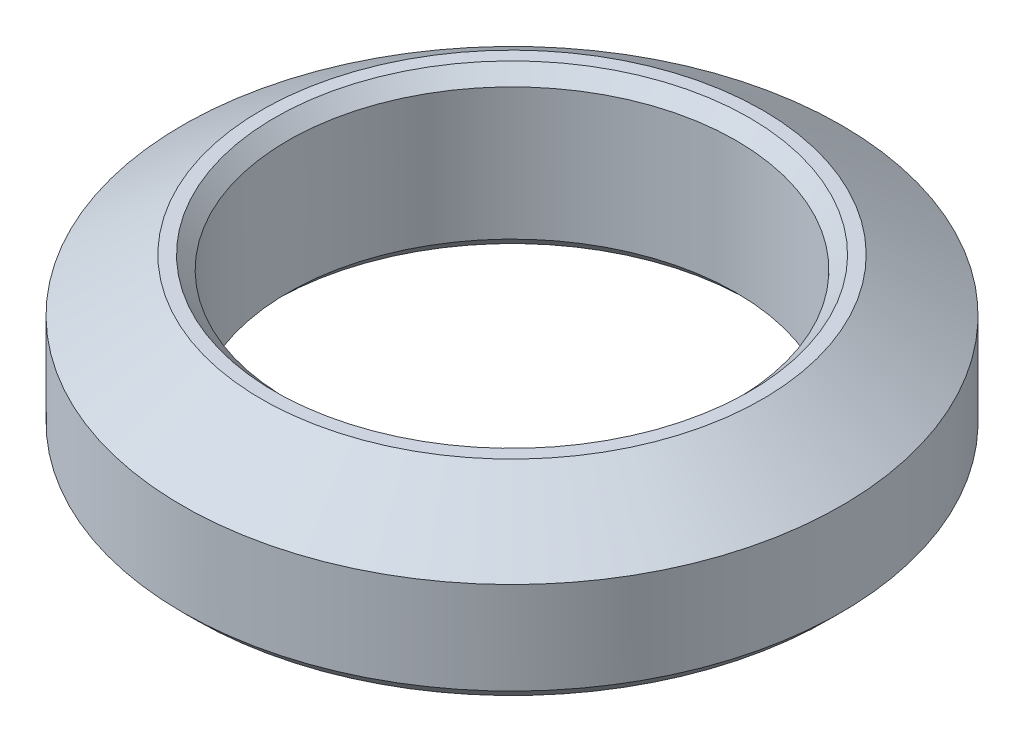
ISO-10303-21;
HEADER;
FILE_DESCRIPTION(('STEP AP214'),'2;1');
FILE_NAME('part.step','',(''),(''),'','','');
FILE_SCHEMA(('AUTOMOTIVE_DESIGN { 1 0 10303 214 1 1 1 1 }'));
ENDSEC;
DATA;
#1=APPLICATION_CONTEXT('core data for automotive mechanical design processes');
#2=APPLICATION_PROTOCOL_DEFINITION('international standard','automotive_design',2000,#1);
#3=PRODUCT_CONTEXT('',#1,'mechanical');
#4=PRODUCT('Part','Part','',(#3));
#5=PRODUCT_RELATED_PRODUCT_CATEGORY('part','',(#4));
#6=PRODUCT_DEFINITION_FORMATION('','',#4);
#7=PRODUCT_DEFINITION_CONTEXT('part definition',#1,'design');
#8=PRODUCT_DEFINITION('design','',#6,#7);
#9=PRODUCT_DEFINITION_SHAPE('','',#8);
#10=(LENGTH_UNIT() NAMED_UNIT(*) SI_UNIT(.MILLI.,.METRE.));
#11=(NAMED_UNIT(*) PLANE_ANGLE_UNIT() SI_UNIT($,.RADIAN.));
#12=(NAMED_UNIT(*) SI_UNIT($,.STERADIAN.) SOLID_ANGLE_UNIT());
#13=UNCERTAINTY_MEASURE_WITH_UNIT(LENGTH_MEASURE(1.E-05),#10,'distance_accuracy_value','');
#14=(GEOMETRIC_REPRESENTATION_CONTEXT(3) GLOBAL_UNCERTAINTY_ASSIGNED_CONTEXT((#13)) GLOBAL_UNIT_ASSIGNED_CONTEXT((#10,
#11,#12)) REPRESENTATION_CONTEXT('',''));
#15=CARTESIAN_POINT('',(0.,0.,0.));
#16=DIRECTION('',(0.,0.,1.));
#17=DIRECTION('',(1.,0.,0.));
#18=AXIS2_PLACEMENT_3D('',#15,#16,#17);
#19=CARTESIAN_POINT('',(-4.75,3.,0.));
#20=DIRECTION('',(0.,-1.,0.));
#21=DIRECTION('',(0.,0.,-1.));
#22=AXIS2_PLACEMENT_3D('',#19,#20,#21);
#23=PLANE('',#22);
#24=CARTESIAN_POINT('',(0.,3.,0.));
#25=DIRECTION('',(0.,-1.,0.));
#26=DIRECTION('',(0.,0.,-1.));
#27=AXIS2_PLACEMENT_3D('',#24,#25,#26);
#28=CIRCLE('',#27,4.5);
#29=CARTESIAN_POINT('',(0.,3.,-4.5));
#30=VERTEX_POINT('',#29);
#31=EDGE_CURVE('E54',#30,#30,#28,.T.);
#32=ORIENTED_EDGE('',*,*,#31,.T.);
#33=EDGE_LOOP('',(#32));
#34=FACE_BOUND('',#33,.T.);
#35=CARTESIAN_POINT('',(0.,3.,0.));
#36=DIRECTION('',(0.,-1.,0.));
#37=DIRECTION('',(0.,0.,-1.));
#38=AXIS2_PLACEMENT_3D('',#35,#36,#37);
#39=CIRCLE('',#38,4.75);
#40=CARTESIAN_POINT('',(0.,3.,-4.75));
#41=VERTEX_POINT('',#40);
#42=EDGE_CURVE('E60',#41,#41,#39,.T.);
#43=ORIENTED_EDGE('',*,*,#42,.F.);
#44=EDGE_LOOP('',(#43));
#45=FACE_BOUND('',#44,.T.);
#46=ADVANCED_FACE('F31',(#34,#45),#23,.F.);
#47=CARTESIAN_POINT('',(0.,0.,0.));
#48=DIRECTION('',(0.,-1.,0.));
#49=DIRECTION('',(0.,0.,-1.));
#50=AXIS2_PLACEMENT_3D('',#47,#48,#49);
#51=CYLINDRICAL_SURFACE('',#50,4.25);
#52=CARTESIAN_POINT('',(0.,2.75,0.));
#53=DIRECTION('',(0.,-1.,0.));
#54=DIRECTION('',(0.,0.,-1.));
#55=AXIS2_PLACEMENT_3D('',#52,#53,#54);
#56=CIRCLE('',#55,4.25);
#57=CARTESIAN_POINT('',(0.,2.75,-4.25));
#58=VERTEX_POINT('',#57);
#59=EDGE_CURVE('E46',#58,#58,#56,.F.);
#60=ORIENTED_EDGE('',*,*,#59,.T.);
#61=EDGE_LOOP('',(#60));
#62=FACE_BOUND('',#61,.T.);
#63=CARTESIAN_POINT('',(0.,0.250000000000003,0.));
#64=DIRECTION('',(0.,1.,0.));
#65=DIRECTION('',(0.,0.,1.));
#66=AXIS2_PLACEMENT_3D('',#63,#64,#65);
#67=CIRCLE('',#66,4.25);
#68=CARTESIAN_POINT('',(0.,0.250000000000003,4.25));
#69=VERTEX_POINT('',#68);
#70=EDGE_CURVE('E51',#69,#69,#67,.F.);
#71=ORIENTED_EDGE('',*,*,#70,.T.);
#72=EDGE_LOOP('',(#71));
#73=FACE_BOUND('',#72,.T.);
#74=ADVANCED_FACE('F67',(#62,#73),#51,.F.);
#75=CARTESIAN_POINT('',(-4.25,0.,0.));
#76=DIRECTION('',(0.,1.,0.));
#77=DIRECTION('',(0.,0.,1.));
#78=AXIS2_PLACEMENT_3D('',#75,#76,#77);
#79=PLANE('',#78);
#80=CARTESIAN_POINT('',(0.,0.,0.));
#81=DIRECTION('',(0.,1.,0.));
#82=DIRECTION('',(0.,0.,1.));
#83=AXIS2_PLACEMENT_3D('',#80,#81,#82);
#84=CIRCLE('',#83,4.5);
#85=CARTESIAN_POINT('',(0.,0.,4.5));
#86=VERTEX_POINT('',#85);
#87=EDGE_CURVE('E38',#86,#86,#84,.T.);
#88=ORIENTED_EDGE('',*,*,#87,.T.);
#89=EDGE_LOOP('',(#88));
#90=FACE_BOUND('',#89,.T.);
#91=CARTESIAN_POINT('',(0.,0.,0.));
#92=DIRECTION('',(0.,1.,0.));
#93=DIRECTION('',(0.,0.,1.));
#94=AXIS2_PLACEMENT_3D('',#91,#92,#93);
#95=CIRCLE('',#94,6.);
#96=CARTESIAN_POINT('',(0.,0.,6.));
#97=VERTEX_POINT('',#96);
#98=EDGE_CURVE('E42',#97,#97,#95,.F.);
#99=ORIENTED_EDGE('',*,*,#98,.T.);
#100=EDGE_LOOP('',(#99));
#101=FACE_BOUND('',#100,.T.);
#102=ADVANCED_FACE('F73',(#90,#101),#79,.F.);
#103=CARTESIAN_POINT('',(0.,0.,0.));
#104=DIRECTION('',(0.,-1.,0.));
#105=DIRECTION('',(0.,0.,-1.));
#106=AXIS2_PLACEMENT_3D('',#103,#104,#105);
#107=CYLINDRICAL_SURFACE('',#106,6.25);
#108=CARTESIAN_POINT('',(0.,0.250000000000003,0.));
#109=DIRECTION('',(0.,1.,0.));
#110=DIRECTION('',(0.,0.,1.));
#111=AXIS2_PLACEMENT_3D('',#108,#109,#110);
#112=CIRCLE('',#111,6.25);
#113=CARTESIAN_POINT('',(0.,0.250000000000003,6.25));
#114=VERTEX_POINT('',#113);
#115=EDGE_CURVE('E10',#114,#114,#112,.T.);
#116=ORIENTED_EDGE('',*,*,#115,.T.);
#117=EDGE_LOOP('',(#116));
#118=FACE_BOUND('',#117,.T.);
#119=CARTESIAN_POINT('',(0.,2.,0.));
#120=DIRECTION('',(0.,-1.,0.));
#121=DIRECTION('',(0.,0.,-1.));
#122=AXIS2_PLACEMENT_3D('',#119,#120,#121);
#123=CIRCLE('',#122,6.25);
#124=CARTESIAN_POINT('',(0.,2.,-6.25));
#125=VERTEX_POINT('',#124);
#126=EDGE_CURVE('E57',#125,#125,#123,.T.);
#127=ORIENTED_EDGE('',*,*,#126,.T.);
#128=EDGE_LOOP('',(#127));
#129=FACE_BOUND('',#128,.T.);
#130=ADVANCED_FACE('F97',(#118,#129),#107,.T.);
#131=CARTESIAN_POINT('',(0.,3.,0.));
#132=DIRECTION('',(0.,-1.,0.));
#133=DIRECTION('',(0.,0.,-1.));
#134=AXIS2_PLACEMENT_3D('',#131,#132,#133);
#135=CONICAL_SURFACE('',#134,4.75,0.982793723247329);
#136=ORIENTED_EDGE('',*,*,#126,.F.);
#137=EDGE_LOOP('',(#136));
#138=FACE_BOUND('',#137,.T.);
#139=ORIENTED_EDGE('',*,*,#42,.T.);
#140=EDGE_LOOP('',(#139));
#141=FACE_BOUND('',#140,.T.);
#142=ADVANCED_FACE('F64',(#138,#141),#135,.T.);
#143=CARTESIAN_POINT('',(0.,3.,0.));
#144=DIRECTION('',(0.,1.,0.));
#145=DIRECTION('',(0.,0.,1.));
#146=AXIS2_PLACEMENT_3D('',#143,#144,#145);
#147=CONICAL_SURFACE('',#146,4.5,0.785398163397447);
#148=ORIENTED_EDGE('',*,*,#59,.F.);
#149=EDGE_LOOP('',(#148));
#150=FACE_BOUND('',#149,.T.);
#151=ORIENTED_EDGE('',*,*,#31,.F.);
#152=EDGE_LOOP('',(#151));
#153=FACE_BOUND('',#152,.T.);
#154=ADVANCED_FACE('F78',(#150,#153),#147,.F.);
#155=CARTESIAN_POINT('',(0.,0.250000000000003,0.));
#156=DIRECTION('',(0.,-1.,0.));
#157=DIRECTION('',(0.,0.,-1.));
#158=AXIS2_PLACEMENT_3D('',#155,#156,#157);
#159=CONICAL_SURFACE('',#158,4.25,0.785398163397447);
#160=ORIENTED_EDGE('',*,*,#87,.F.);
#161=EDGE_LOOP('',(#160));
#162=FACE_BOUND('',#161,.T.);
#163=ORIENTED_EDGE('',*,*,#70,.F.);
#164=EDGE_LOOP('',(#163));
#165=FACE_BOUND('',#164,.T.);
#166=ADVANCED_FACE('F80',(#162,#165),#159,.F.);
#167=CARTESIAN_POINT('',(0.,0.,0.));
#168=DIRECTION('',(0.,1.,0.));
#169=DIRECTION('',(0.,0.,1.));
#170=AXIS2_PLACEMENT_3D('',#167,#168,#169);
#171=CONICAL_SURFACE('',#170,6.,0.78539816339744);
#172=ORIENTED_EDGE('',*,*,#115,.F.);
#173=EDGE_LOOP('',(#172));
#174=FACE_BOUND('',#173,.T.);
#175=ORIENTED_EDGE('',*,*,#98,.F.);
#176=EDGE_LOOP('',(#175));
#177=FACE_BOUND('',#176,.T.);
#178=ADVANCED_FACE('F33',(#174,#177),#171,.T.);
#179=CLOSED_SHELL('',(#46,#74,#102,#130,#142,#154,#166,#178));
#180=MANIFOLD_SOLID_BREP('B2',#179);
#181=ADVANCED_BREP_SHAPE_REPRESENTATION('',(#18,#180),#14);
#182=SHAPE_DEFINITION_REPRESENTATION(#9,#181);
ENDSEC;
END-ISO-10303-21;
